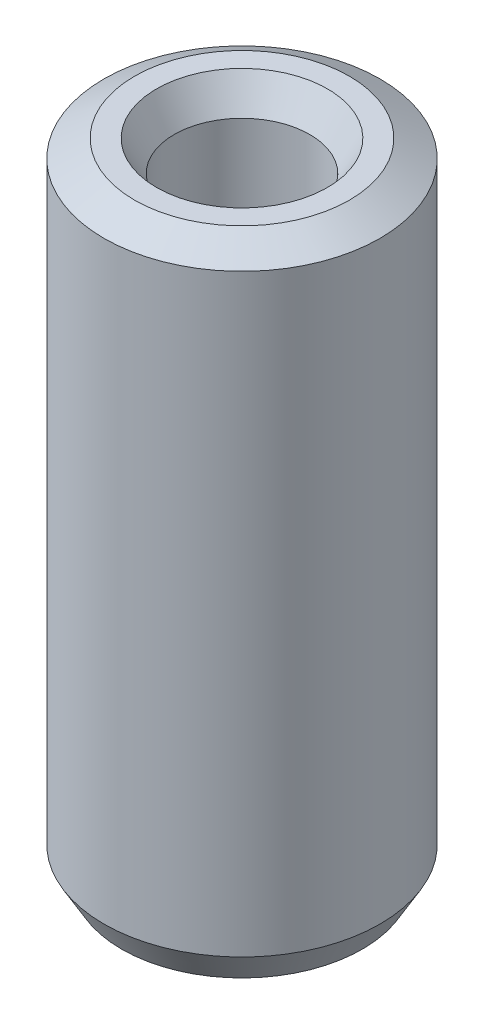
ISO-10303-21;
HEADER;
FILE_DESCRIPTION(('STEP AP214'),'2;1');
FILE_NAME('part.step','',(''),(''),'','','');
FILE_SCHEMA(('AUTOMOTIVE_DESIGN { 1 0 10303 214 1 1 1 1 }'));
ENDSEC;
DATA;
#1=APPLICATION_CONTEXT('core data for automotive mechanical design processes');
#2=APPLICATION_PROTOCOL_DEFINITION('international standard','automotive_design',2000,#1);
#3=PRODUCT_CONTEXT('',#1,'mechanical');
#4=PRODUCT('Part','Part','',(#3));
#5=PRODUCT_RELATED_PRODUCT_CATEGORY('part','',(#4));
#6=PRODUCT_DEFINITION_FORMATION('','',#4);
#7=PRODUCT_DEFINITION_CONTEXT('part definition',#1,'design');
#8=PRODUCT_DEFINITION('design','',#6,#7);
#9=PRODUCT_DEFINITION_SHAPE('','',#8);
#10=(LENGTH_UNIT() NAMED_UNIT(*) SI_UNIT(.MILLI.,.METRE.));
#11=(NAMED_UNIT(*) PLANE_ANGLE_UNIT() SI_UNIT($,.RADIAN.));
#12=(NAMED_UNIT(*) SI_UNIT($,.STERADIAN.) SOLID_ANGLE_UNIT());
#13=UNCERTAINTY_MEASURE_WITH_UNIT(LENGTH_MEASURE(1.E-05),#10,'distance_accuracy_value','');
#14=(GEOMETRIC_REPRESENTATION_CONTEXT(3) GLOBAL_UNCERTAINTY_ASSIGNED_CONTEXT((#13)) GLOBAL_UNIT_ASSIGNED_CONTEXT((#10,
#11,#12)) REPRESENTATION_CONTEXT('',''));
#15=CARTESIAN_POINT('',(0.,0.,0.));
#16=DIRECTION('',(0.,0.,1.));
#17=DIRECTION('',(1.,0.,0.));
#18=AXIS2_PLACEMENT_3D('',#15,#16,#17);
#19=CARTESIAN_POINT('',(0.,139.543938747363,0.));
#20=DIRECTION('',(0.,-1.,0.));
#21=DIRECTION('',(0.,0.,-1.));
#22=AXIS2_PLACEMENT_3D('',#19,#20,#21);
#23=CYLINDRICAL_SURFACE('',#22,30.);
#24=CARTESIAN_POINT('',(0.,6.6634004795908,0.));
#25=DIRECTION('',(0.,1.,0.));
#26=DIRECTION('',(0.,0.,1.));
#27=AXIS2_PLACEMENT_3D('',#24,#25,#26);
#28=CIRCLE('',#27,30.);
#29=CARTESIAN_POINT('',(0.,6.6634004795908,30.));
#30=VERTEX_POINT('',#29);
#31=EDGE_CURVE('E10',#30,#30,#28,.T.);
#32=ORIENTED_EDGE('',*,*,#31,.T.);
#33=EDGE_LOOP('',(#32));
#34=FACE_BOUND('',#33,.T.);
#35=CARTESIAN_POINT('',(0.,135.696822686753,0.));
#36=DIRECTION('',(0.,1.,0.));
#37=DIRECTION('',(0.,0.,1.));
#38=AXIS2_PLACEMENT_3D('',#35,#36,#37);
#39=CIRCLE('',#38,30.);
#40=CARTESIAN_POINT('',(0.,135.696822686753,30.));
#41=VERTEX_POINT('',#40);
#42=EDGE_CURVE('E50',#41,#41,#39,.F.);
#43=ORIENTED_EDGE('',*,*,#42,.T.);
#44=EDGE_LOOP('',(#43));
#45=FACE_BOUND('',#44,.T.);
#46=ADVANCED_FACE('F39',(#34,#45),#23,.T.);
#47=CARTESIAN_POINT('',(0.,139.543938747363,0.));
#48=DIRECTION('',(0.,1.,0.));
#49=DIRECTION('',(0.,0.,1.));
#50=AXIS2_PLACEMENT_3D('',#47,#48,#49);
#51=PLANE('',#50);
#52=CARTESIAN_POINT('',(0.,139.543938747363,0.));
#53=DIRECTION('',(0.,1.,0.));
#54=DIRECTION('',(0.,0.,1.));
#55=AXIS2_PLACEMENT_3D('',#52,#53,#54);
#56=CIRCLE('',#55,18.5723037229682);
#57=CARTESIAN_POINT('',(0.,139.543938747363,18.5723037229682));
#58=VERTEX_POINT('',#57);
#59=EDGE_CURVE('E58',#58,#58,#56,.F.);
#60=ORIENTED_EDGE('',*,*,#59,.T.);
#61=EDGE_LOOP('',(#60));
#62=FACE_BOUND('',#61,.T.);
#63=CARTESIAN_POINT('',(0.,139.543938747363,0.));
#64=DIRECTION('',(0.,1.,0.));
#65=DIRECTION('',(0.,0.,1.));
#66=AXIS2_PLACEMENT_3D('',#63,#64,#65);
#67=CIRCLE('',#66,23.3365995204093);
#68=CARTESIAN_POINT('',(0.,139.543938747363,23.3365995204093));
#69=VERTEX_POINT('',#68);
#70=EDGE_CURVE('E61',#69,#69,#67,.T.);
#71=ORIENTED_EDGE('',*,*,#70,.T.);
#72=EDGE_LOOP('',(#71));
#73=FACE_BOUND('',#72,.T.);
#74=ADVANCED_FACE('F88',(#62,#73),#51,.T.);
#75=CARTESIAN_POINT('',(0.,0.,0.));
#76=DIRECTION('',(0.,1.,0.));
#77=DIRECTION('',(0.,0.,1.));
#78=AXIS2_PLACEMENT_3D('',#75,#76,#77);
#79=PLANE('',#78);
#80=CARTESIAN_POINT('',(0.,0.,0.));
#81=DIRECTION('',(0.,1.,0.));
#82=DIRECTION('',(0.,0.,1.));
#83=AXIS2_PLACEMENT_3D('',#80,#81,#82);
#84=CIRCLE('',#83,21.3885881419489);
#85=CARTESIAN_POINT('',(0.,0.,21.3885881419489));
#86=VERTEX_POINT('',#85);
#87=EDGE_CURVE('E51',#86,#86,#84,.T.);
#88=ORIENTED_EDGE('',*,*,#87,.T.);
#89=EDGE_LOOP('',(#88));
#90=FACE_BOUND('',#89,.T.);
#91=CARTESIAN_POINT('',(0.,0.,0.));
#92=DIRECTION('',(0.,1.,0.));
#93=DIRECTION('',(0.,0.,1.));
#94=AXIS2_PLACEMENT_3D('',#91,#92,#93);
#95=CIRCLE('',#94,26.1528839393899);
#96=CARTESIAN_POINT('',(0.,0.,26.1528839393899));
#97=VERTEX_POINT('',#96);
#98=EDGE_CURVE('E54',#97,#97,#95,.F.);
#99=ORIENTED_EDGE('',*,*,#98,.T.);
#100=EDGE_LOOP('',(#99));
#101=FACE_BOUND('',#100,.T.);
#102=ADVANCED_FACE('F83',(#90,#101),#79,.F.);
#103=CARTESIAN_POINT('',(0.,139.543938747363,0.));
#104=DIRECTION('',(0.,-1.,0.));
#105=DIRECTION('',(0.,0.,-1.));
#106=AXIS2_PLACEMENT_3D('',#103,#104,#105);
#107=CYLINDRICAL_SURFACE('',#106,14.7251876623582);
#108=CARTESIAN_POINT('',(0.,132.880538267772,0.));
#109=DIRECTION('',(0.,1.,0.));
#110=DIRECTION('',(0.,0.,1.));
#111=AXIS2_PLACEMENT_3D('',#108,#109,#110);
#112=CIRCLE('',#111,14.7251876623582);
#113=CARTESIAN_POINT('',(0.,132.880538267772,14.7251876623582));
#114=VERTEX_POINT('',#113);
#115=EDGE_CURVE('E67',#114,#114,#112,.T.);
#116=ORIENTED_EDGE('',*,*,#115,.T.);
#117=EDGE_LOOP('',(#116));
#118=FACE_BOUND('',#117,.T.);
#119=CARTESIAN_POINT('',(0.,3.84711606061003,0.));
#120=DIRECTION('',(0.,1.,0.));
#121=DIRECTION('',(0.,0.,1.));
#122=AXIS2_PLACEMENT_3D('',#119,#120,#121);
#123=CIRCLE('',#122,14.7251876623582);
#124=CARTESIAN_POINT('',(0.,3.84711606061003,14.7251876623582));
#125=VERTEX_POINT('',#124);
#126=EDGE_CURVE('E69',#125,#125,#123,.F.);
#127=ORIENTED_EDGE('',*,*,#126,.T.);
#128=EDGE_LOOP('',(#127));
#129=FACE_BOUND('',#128,.T.);
#130=ADVANCED_FACE('F71',(#118,#129),#107,.F.);
#131=CARTESIAN_POINT('',(0.,132.880538267772,0.));
#132=DIRECTION('',(0.,1.,0.));
#133=DIRECTION('',(0.,0.,1.));
#134=AXIS2_PLACEMENT_3D('',#131,#132,#133);
#135=CONICAL_SURFACE('',#134,14.7251876623582,0.523598775598301);
#136=ORIENTED_EDGE('',*,*,#59,.F.);
#137=EDGE_LOOP('',(#136));
#138=FACE_BOUND('',#137,.T.);
#139=ORIENTED_EDGE('',*,*,#115,.F.);
#140=EDGE_LOOP('',(#139));
#141=FACE_BOUND('',#140,.T.);
#142=ADVANCED_FACE('F77',(#138,#141),#135,.F.);
#143=CARTESIAN_POINT('',(0.,0.,0.));
#144=DIRECTION('',(0.,-1.,0.));
#145=DIRECTION('',(0.,0.,-1.));
#146=AXIS2_PLACEMENT_3D('',#143,#144,#145);
#147=CONICAL_SURFACE('',#146,21.3885881419489,1.04719755119659);
#148=ORIENTED_EDGE('',*,*,#126,.F.);
#149=EDGE_LOOP('',(#148));
#150=FACE_BOUND('',#149,.T.);
#151=ORIENTED_EDGE('',*,*,#87,.F.);
#152=EDGE_LOOP('',(#151));
#153=FACE_BOUND('',#152,.T.);
#154=ADVANCED_FACE('F73',(#150,#153),#147,.F.);
#155=CARTESIAN_POINT('',(0.,6.6634004795908,0.));
#156=DIRECTION('',(0.,1.,0.));
#157=DIRECTION('',(0.,0.,1.));
#158=AXIS2_PLACEMENT_3D('',#155,#156,#157);
#159=CONICAL_SURFACE('',#158,30.,0.523598775598301);
#160=ORIENTED_EDGE('',*,*,#98,.F.);
#161=EDGE_LOOP('',(#160));
#162=FACE_BOUND('',#161,.T.);
#163=ORIENTED_EDGE('',*,*,#31,.F.);
#164=EDGE_LOOP('',(#163));
#165=FACE_BOUND('',#164,.T.);
#166=ADVANCED_FACE('F76',(#162,#165),#159,.T.);
#167=CARTESIAN_POINT('',(0.,139.543938747363,0.));
#168=DIRECTION('',(0.,-1.,0.));
#169=DIRECTION('',(0.,0.,-1.));
#170=AXIS2_PLACEMENT_3D('',#167,#168,#169);
#171=CONICAL_SURFACE('',#170,23.3365995204093,1.04719755119659);
#172=ORIENTED_EDGE('',*,*,#42,.F.);
#173=EDGE_LOOP('',(#172));
#174=FACE_BOUND('',#173,.T.);
#175=ORIENTED_EDGE('',*,*,#70,.F.);
#176=EDGE_LOOP('',(#175));
#177=FACE_BOUND('',#176,.T.);
#178=ADVANCED_FACE('F45',(#174,#177),#171,.T.);
#179=CLOSED_SHELL('',(#46,#74,#102,#130,#142,#154,#166,#178));
#180=MANIFOLD_SOLID_BREP('B2',#179);
#181=ADVANCED_BREP_SHAPE_REPRESENTATION('',(#18,#180),#14);
#182=SHAPE_DEFINITION_REPRESENTATION(#9,#181);
ENDSEC;
END-ISO-10303-21;
